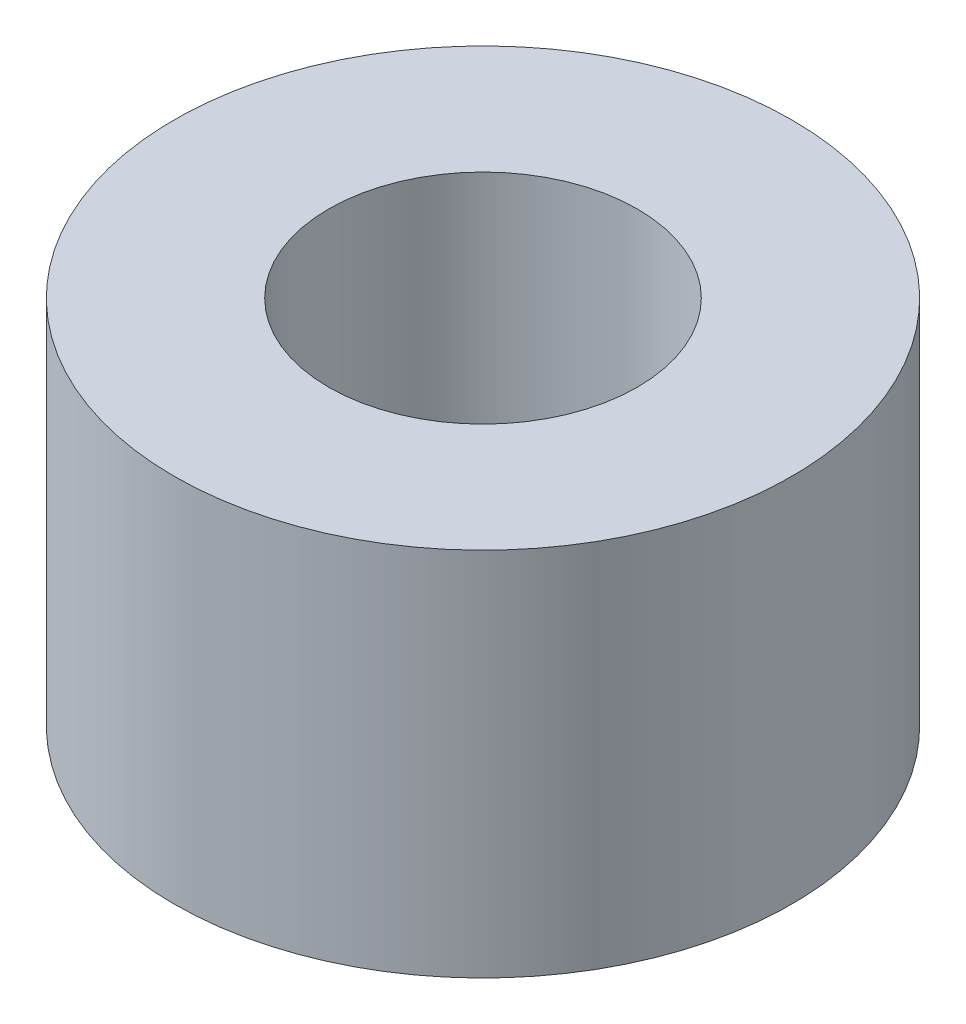
ISO-10303-21;
HEADER;
FILE_DESCRIPTION(('STEP AP214'),'2;1');
FILE_NAME('part.step','',(''),(''),'','','');
FILE_SCHEMA(('AUTOMOTIVE_DESIGN { 1 0 10303 214 1 1 1 1 }'));
ENDSEC;
DATA;
#1=APPLICATION_CONTEXT('core data for automotive mechanical design processes');
#2=APPLICATION_PROTOCOL_DEFINITION('international standard','automotive_design',2000,#1);
#3=PRODUCT_CONTEXT('',#1,'mechanical');
#4=PRODUCT('Part','Part','',(#3));
#5=PRODUCT_RELATED_PRODUCT_CATEGORY('part','',(#4));
#6=PRODUCT_DEFINITION_FORMATION('','',#4);
#7=PRODUCT_DEFINITION_CONTEXT('part definition',#1,'design');
#8=PRODUCT_DEFINITION('design','',#6,#7);
#9=PRODUCT_DEFINITION_SHAPE('','',#8);
#10=(LENGTH_UNIT() NAMED_UNIT(*) SI_UNIT(.MILLI.,.METRE.));
#11=(NAMED_UNIT(*) PLANE_ANGLE_UNIT() SI_UNIT($,.RADIAN.));
#12=(NAMED_UNIT(*) SI_UNIT($,.STERADIAN.) SOLID_ANGLE_UNIT());
#13=UNCERTAINTY_MEASURE_WITH_UNIT(LENGTH_MEASURE(1.E-05),#10,'distance_accuracy_value','');
#14=(GEOMETRIC_REPRESENTATION_CONTEXT(3) GLOBAL_UNCERTAINTY_ASSIGNED_CONTEXT((#13)) GLOBAL_UNIT_ASSIGNED_CONTEXT((#10,
#11,#12)) REPRESENTATION_CONTEXT('',''));
#15=CARTESIAN_POINT('',(0.,0.,0.));
#16=DIRECTION('',(0.,0.,1.));
#17=DIRECTION('',(1.,0.,0.));
#18=AXIS2_PLACEMENT_3D('',#15,#16,#17);
#19=CARTESIAN_POINT('',(0.,-2.,0.));
#20=DIRECTION('',(0.,1.,0.));
#21=DIRECTION('',(0.,0.,1.));
#22=AXIS2_PLACEMENT_3D('',#19,#20,#21);
#23=CYLINDRICAL_SURFACE('',#22,5.);
#24=CARTESIAN_POINT('',(0.,3.,0.));
#25=DIRECTION('',(0.,1.,0.));
#26=DIRECTION('',(0.,0.,1.));
#27=AXIS2_PLACEMENT_3D('',#24,#25,#26);
#28=CIRCLE('',#27,5.);
#29=CARTESIAN_POINT('',(0.,3.,5.));
#30=VERTEX_POINT('',#29);
#31=EDGE_CURVE('E50',#30,#30,#28,.T.);
#32=ORIENTED_EDGE('',*,*,#31,.F.);
#33=EDGE_LOOP('',(#32));
#34=FACE_BOUND('',#33,.T.);
#35=CARTESIAN_POINT('',(0.,-3.,0.));
#36=DIRECTION('',(0.,-1.,0.));
#37=DIRECTION('',(0.,0.,-1.));
#38=AXIS2_PLACEMENT_3D('',#35,#36,#37);
#39=CIRCLE('',#38,5.);
#40=CARTESIAN_POINT('',(0.,-3.,-5.));
#41=VERTEX_POINT('',#40);
#42=EDGE_CURVE('E60',#41,#41,#39,.T.);
#43=ORIENTED_EDGE('',*,*,#42,.F.);
#44=EDGE_LOOP('',(#43));
#45=FACE_BOUND('',#44,.T.);
#46=ADVANCED_FACE('F43',(#34,#45),#23,.T.);
#47=CARTESIAN_POINT('',(0.,-2.,0.));
#48=DIRECTION('',(0.,1.,0.));
#49=DIRECTION('',(0.,0.,1.));
#50=AXIS2_PLACEMENT_3D('',#47,#48,#49);
#51=CYLINDRICAL_SURFACE('',#50,2.5);
#52=CARTESIAN_POINT('',(0.,-2.,0.));
#53=DIRECTION('',(0.,1.,0.));
#54=DIRECTION('',(0.,0.,1.));
#55=AXIS2_PLACEMENT_3D('',#52,#53,#54);
#56=CIRCLE('',#55,2.5);
#57=CARTESIAN_POINT('',(0.,-2.,2.5));
#58=VERTEX_POINT('',#57);
#59=EDGE_CURVE('E10',#58,#58,#56,.T.);
#60=ORIENTED_EDGE('',*,*,#59,.F.);
#61=EDGE_LOOP('',(#60));
#62=FACE_BOUND('',#61,.T.);
#63=CARTESIAN_POINT('',(0.,3.,0.));
#64=DIRECTION('',(0.,1.,0.));
#65=DIRECTION('',(0.,0.,1.));
#66=AXIS2_PLACEMENT_3D('',#63,#64,#65);
#67=CIRCLE('',#66,2.5);
#68=CARTESIAN_POINT('',(0.,3.,2.5));
#69=VERTEX_POINT('',#68);
#70=EDGE_CURVE('E55',#69,#69,#67,.T.);
#71=ORIENTED_EDGE('',*,*,#70,.T.);
#72=EDGE_LOOP('',(#71));
#73=FACE_BOUND('',#72,.T.);
#74=ADVANCED_FACE('F85',(#62,#73),#51,.F.);
#75=CARTESIAN_POINT('',(0.,3.,0.));
#76=DIRECTION('',(0.,1.,0.));
#77=DIRECTION('',(0.,0.,1.));
#78=AXIS2_PLACEMENT_3D('',#75,#76,#77);
#79=PLANE('',#78);
#80=ORIENTED_EDGE('',*,*,#31,.T.);
#81=EDGE_LOOP('',(#80));
#82=FACE_BOUND('',#81,.T.);
#83=ORIENTED_EDGE('',*,*,#70,.F.);
#84=EDGE_LOOP('',(#83));
#85=FACE_BOUND('',#84,.T.);
#86=ADVANCED_FACE('F92',(#82,#85),#79,.T.);
#87=CARTESIAN_POINT('',(0.,-2.,0.));
#88=DIRECTION('',(0.,-1.,0.));
#89=DIRECTION('',(0.,0.,-1.));
#90=AXIS2_PLACEMENT_3D('',#87,#88,#89);
#91=PLANE('',#90);
#92=CARTESIAN_POINT('',(0.,-2.,0.));
#93=DIRECTION('',(0.,-1.,0.));
#94=DIRECTION('',(0.,0.,-1.));
#95=AXIS2_PLACEMENT_3D('',#92,#93,#94);
#96=CIRCLE('',#95,1.15);
#97=CARTESIAN_POINT('',(0.,-2.,-1.15));
#98=VERTEX_POINT('',#97);
#99=EDGE_CURVE('E66',#98,#98,#96,.F.);
#100=ORIENTED_EDGE('',*,*,#99,.F.);
#101=EDGE_LOOP('',(#100));
#102=FACE_BOUND('',#101,.T.);
#103=ORIENTED_EDGE('',*,*,#59,.T.);
#104=EDGE_LOOP('',(#103));
#105=FACE_BOUND('',#104,.T.);
#106=ADVANCED_FACE('F80',(#102,#105),#91,.F.);
#107=CARTESIAN_POINT('',(0.,-3.,0.));
#108=DIRECTION('',(0.,-1.,0.));
#109=DIRECTION('',(0.,0.,-1.));
#110=AXIS2_PLACEMENT_3D('',#107,#108,#109);
#111=PLANE('',#110);
#112=CARTESIAN_POINT('',(0.,-3.,0.));
#113=DIRECTION('',(0.,-1.,0.));
#114=DIRECTION('',(0.,0.,-1.));
#115=AXIS2_PLACEMENT_3D('',#112,#113,#114);
#116=CIRCLE('',#115,1.15);
#117=CARTESIAN_POINT('',(0.,-3.,-1.15));
#118=VERTEX_POINT('',#117);
#119=EDGE_CURVE('E70',#118,#118,#116,.T.);
#120=ORIENTED_EDGE('',*,*,#119,.F.);
#121=EDGE_LOOP('',(#120));
#122=FACE_BOUND('',#121,.T.);
#123=ORIENTED_EDGE('',*,*,#42,.T.);
#124=EDGE_LOOP('',(#123));
#125=FACE_BOUND('',#124,.T.);
#126=ADVANCED_FACE('F77',(#122,#125),#111,.T.);
#127=CARTESIAN_POINT('',(0.,1.25269119345812,0.));
#128=DIRECTION('',(0.,-1.,0.));
#129=DIRECTION('',(0.,0.,-1.));
#130=AXIS2_PLACEMENT_3D('',#127,#128,#129);
#131=CYLINDRICAL_SURFACE('',#130,1.15);
#132=ORIENTED_EDGE('',*,*,#99,.T.);
#133=EDGE_LOOP('',(#132));
#134=FACE_BOUND('',#133,.T.);
#135=ORIENTED_EDGE('',*,*,#119,.T.);
#136=EDGE_LOOP('',(#135));
#137=FACE_BOUND('',#136,.T.);
#138=ADVANCED_FACE('F75',(#134,#137),#131,.F.);
#139=CLOSED_SHELL('',(#46,#74,#86,#106,#126,#138));
#140=MANIFOLD_SOLID_BREP('B2',#139);
#141=ADVANCED_BREP_SHAPE_REPRESENTATION('',(#18,#140),#14);
#142=SHAPE_DEFINITION_REPRESENTATION(#9,#141);
ENDSEC;
END-ISO-10303-21;
